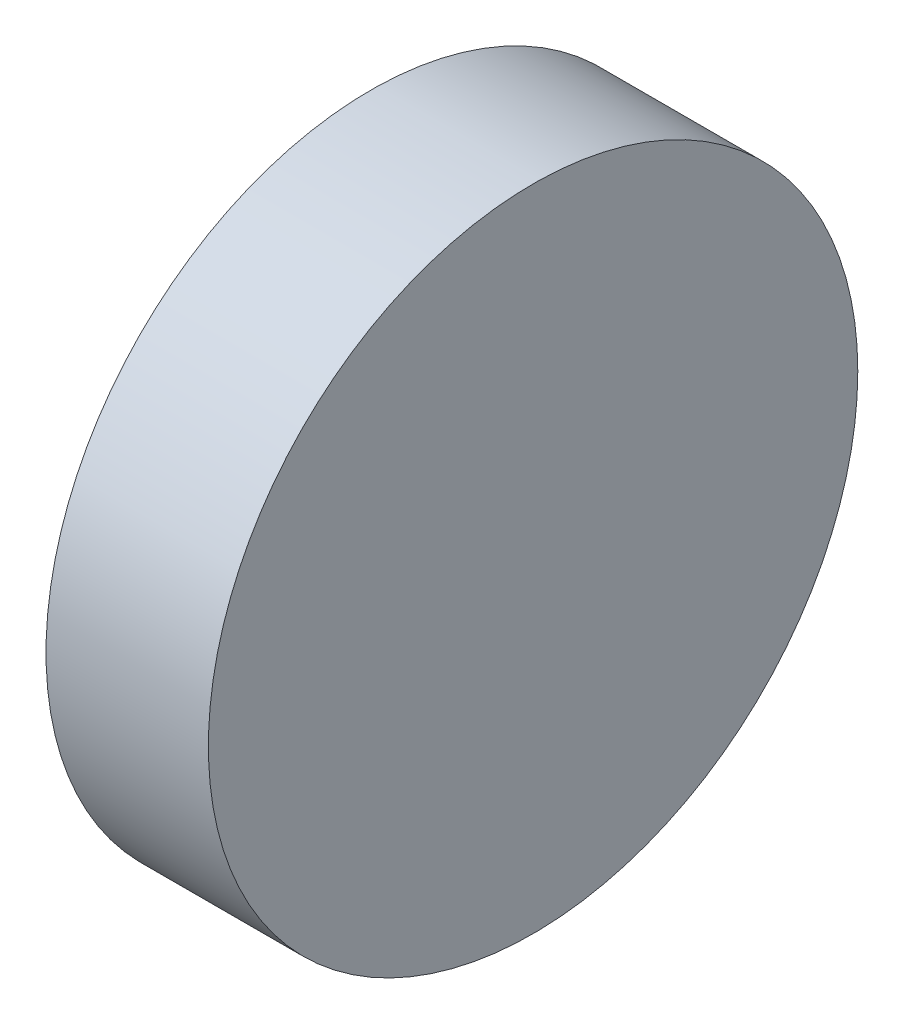
ISO-10303-21;
HEADER;
FILE_DESCRIPTION(('STEP AP214'),'2;1');
FILE_NAME('part.step','',(''),(''),'','','');
FILE_SCHEMA(('AUTOMOTIVE_DESIGN { 1 0 10303 214 1 1 1 1 }'));
ENDSEC;
DATA;
#1=APPLICATION_CONTEXT('core data for automotive mechanical design processes');
#2=APPLICATION_PROTOCOL_DEFINITION('international standard','automotive_design',2000,#1);
#3=PRODUCT_CONTEXT('',#1,'mechanical');
#4=PRODUCT('Part','Part','',(#3));
#5=PRODUCT_RELATED_PRODUCT_CATEGORY('part','',(#4));
#6=PRODUCT_DEFINITION_FORMATION('','',#4);
#7=PRODUCT_DEFINITION_CONTEXT('part definition',#1,'design');
#8=PRODUCT_DEFINITION('design','',#6,#7);
#9=PRODUCT_DEFINITION_SHAPE('','',#8);
#10=(LENGTH_UNIT() NAMED_UNIT(*) SI_UNIT(.MILLI.,.METRE.));
#11=(NAMED_UNIT(*) PLANE_ANGLE_UNIT() SI_UNIT($,.RADIAN.));
#12=(NAMED_UNIT(*) SI_UNIT($,.STERADIAN.) SOLID_ANGLE_UNIT());
#13=UNCERTAINTY_MEASURE_WITH_UNIT(LENGTH_MEASURE(1.E-05),#10,'distance_accuracy_value','');
#14=(GEOMETRIC_REPRESENTATION_CONTEXT(3) GLOBAL_UNCERTAINTY_ASSIGNED_CONTEXT((#13)) GLOBAL_UNIT_ASSIGNED_CONTEXT((#10,
#11,#12)) REPRESENTATION_CONTEXT('',''));
#15=CARTESIAN_POINT('',(0.,0.,0.));
#16=DIRECTION('',(0.,0.,1.));
#17=DIRECTION('',(1.,0.,0.));
#18=AXIS2_PLACEMENT_3D('',#15,#16,#17);
#19=CARTESIAN_POINT('',(10.,0.,0.));
#20=DIRECTION('',(-1.,0.,0.));
#21=DIRECTION('',(0.,0.,1.));
#22=AXIS2_PLACEMENT_3D('',#19,#20,#21);
#23=CYLINDRICAL_SURFACE('',#22,20.);
#24=CARTESIAN_POINT('',(10.,0.,0.));
#25=DIRECTION('',(1.,0.,0.));
#26=DIRECTION('',(0.,0.,-1.));
#27=AXIS2_PLACEMENT_3D('',#24,#25,#26);
#28=CIRCLE('',#27,20.);
#29=CARTESIAN_POINT('',(10.,0.,-20.));
#30=VERTEX_POINT('',#29);
#31=EDGE_CURVE('E10',#30,#30,#28,.T.);
#32=ORIENTED_EDGE('',*,*,#31,.F.);
#33=EDGE_LOOP('',(#32));
#34=FACE_BOUND('',#33,.T.);
#35=CARTESIAN_POINT('',(0.,0.,0.));
#36=DIRECTION('',(1.,0.,0.));
#37=DIRECTION('',(0.,0.,-1.));
#38=AXIS2_PLACEMENT_3D('',#35,#36,#37);
#39=CIRCLE('',#38,20.);
#40=CARTESIAN_POINT('',(0.,0.,-20.));
#41=VERTEX_POINT('',#40);
#42=EDGE_CURVE('E36',#41,#41,#39,.T.);
#43=ORIENTED_EDGE('',*,*,#42,.T.);
#44=EDGE_LOOP('',(#43));
#45=FACE_BOUND('',#44,.T.);
#46=ADVANCED_FACE('F33',(#34,#45),#23,.T.);
#47=CARTESIAN_POINT('',(10.,0.,0.));
#48=DIRECTION('',(1.,0.,0.));
#49=DIRECTION('',(0.,0.,-1.));
#50=AXIS2_PLACEMENT_3D('',#47,#48,#49);
#51=PLANE('',#50);
#52=ORIENTED_EDGE('',*,*,#31,.T.);
#53=EDGE_LOOP('',(#52));
#54=FACE_BOUND('',#53,.T.);
#55=ADVANCED_FACE('F48',(#54),#51,.T.);
#56=CARTESIAN_POINT('',(0.,0.,0.));
#57=DIRECTION('',(1.,0.,0.));
#58=DIRECTION('',(0.,0.,-1.));
#59=AXIS2_PLACEMENT_3D('',#56,#57,#58);
#60=PLANE('',#59);
#61=ORIENTED_EDGE('',*,*,#42,.F.);
#62=EDGE_LOOP('',(#61));
#63=FACE_BOUND('',#62,.T.);
#64=ADVANCED_FACE('F46',(#63),#60,.F.);
#65=CLOSED_SHELL('',(#46,#55,#64));
#66=MANIFOLD_SOLID_BREP('B2',#65);
#67=ADVANCED_BREP_SHAPE_REPRESENTATION('',(#18,#66),#14);
#68=SHAPE_DEFINITION_REPRESENTATION(#9,#67);
ENDSEC;
END-ISO-10303-21;
